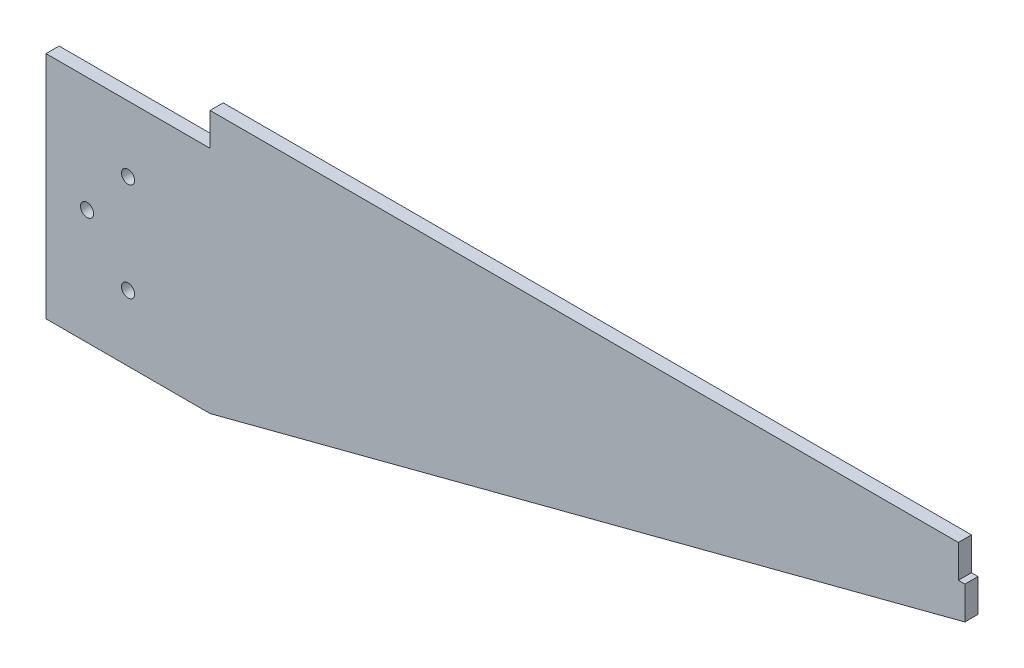
ISO-10303-21;
HEADER;
FILE_DESCRIPTION(('STEP AP214'),'2;1');
FILE_NAME('part.step','',(''),(''),'','','');
FILE_SCHEMA(('AUTOMOTIVE_DESIGN { 1 0 10303 214 1 1 1 1 }'));
ENDSEC;
DATA;
#1=APPLICATION_CONTEXT('core data for automotive mechanical design processes');
#2=APPLICATION_PROTOCOL_DEFINITION('international standard','automotive_design',2000,#1);
#3=PRODUCT_CONTEXT('',#1,'mechanical');
#4=PRODUCT('Part','Part','',(#3));
#5=PRODUCT_RELATED_PRODUCT_CATEGORY('part','',(#4));
#6=PRODUCT_DEFINITION_FORMATION('','',#4);
#7=PRODUCT_DEFINITION_CONTEXT('part definition',#1,'design');
#8=PRODUCT_DEFINITION('design','',#6,#7);
#9=PRODUCT_DEFINITION_SHAPE('','',#8);
#10=(LENGTH_UNIT() NAMED_UNIT(*) SI_UNIT(.MILLI.,.METRE.));
#11=(NAMED_UNIT(*) PLANE_ANGLE_UNIT() SI_UNIT($,.RADIAN.));
#12=(NAMED_UNIT(*) SI_UNIT($,.STERADIAN.) SOLID_ANGLE_UNIT());
#13=UNCERTAINTY_MEASURE_WITH_UNIT(LENGTH_MEASURE(1.E-05),#10,'distance_accuracy_value','');
#14=(GEOMETRIC_REPRESENTATION_CONTEXT(3) GLOBAL_UNCERTAINTY_ASSIGNED_CONTEXT((#13)) GLOBAL_UNIT_ASSIGNED_CONTEXT((#10,
#11,#12)) REPRESENTATION_CONTEXT('',''));
#15=CARTESIAN_POINT('',(0.,0.,0.));
#16=DIRECTION('',(0.,0.,1.));
#17=DIRECTION('',(1.,0.,0.));
#18=AXIS2_PLACEMENT_3D('',#15,#16,#17);
#19=CARTESIAN_POINT('',(130.000000000003,30.0929904361689,4.));
#20=DIRECTION('',(-7.7715611723666E-13,-1.,0.));
#21=DIRECTION('',(1.,-7.7715611723666E-13,0.));
#22=AXIS2_PLACEMENT_3D('',#19,#20,#21);
#23=PLANE('',#22);
#24=DIRECTION('',(-1.,7.7715611723666E-13,0.));
#25=VECTOR('',#24,1.);
#26=CARTESIAN_POINT('',(130.000000000003,30.0929904361689,0.));
#27=LINE('',#26,#25);
#28=CARTESIAN_POINT('',(130.000000000003,30.0929904361689,0.));
#29=VERTEX_POINT('',#28);
#30=CARTESIAN_POINT('',(128.,30.0929904361704,0.));
#31=VERTEX_POINT('',#30);
#32=EDGE_CURVE('E135',#29,#31,#27,.T.);
#33=ORIENTED_EDGE('',*,*,#32,.T.);
#34=DIRECTION('',(0.,0.,-1.));
#35=VECTOR('',#34,1.);
#36=CARTESIAN_POINT('',(128.,30.0929904361704,4.));
#37=LINE('',#36,#35);
#38=CARTESIAN_POINT('',(128.,30.0929904361704,4.));
#39=VERTEX_POINT('',#38);
#40=EDGE_CURVE('E11',#39,#31,#37,.T.);
#41=ORIENTED_EDGE('',*,*,#40,.F.);
#42=DIRECTION('',(-1.,7.7715611723666E-13,0.));
#43=VECTOR('',#42,1.);
#44=CARTESIAN_POINT('',(130.000000000003,30.0929904361689,4.));
#45=LINE('',#44,#43);
#46=CARTESIAN_POINT('',(130.000000000003,30.0929904361689,4.));
#47=VERTEX_POINT('',#46);
#48=EDGE_CURVE('E136',#47,#39,#45,.T.);
#49=ORIENTED_EDGE('',*,*,#48,.F.);
#50=DIRECTION('',(0.,0.,-1.));
#51=VECTOR('',#50,1.);
#52=CARTESIAN_POINT('',(130.000000000003,30.0929904361689,4.));
#53=LINE('',#52,#51);
#54=EDGE_CURVE('E152',#47,#29,#53,.T.);
#55=ORIENTED_EDGE('',*,*,#54,.T.);
#56=EDGE_LOOP('',(#33,#41,#49,#55));
#57=FACE_BOUND('',#56,.T.);
#58=ADVANCED_FACE('F36',(#57),#23,.F.);
#59=CARTESIAN_POINT('',(128.,30.0929904361704,4.));
#60=DIRECTION('',(-1.,0.,0.));
#61=DIRECTION('',(0.,0.,1.));
#62=AXIS2_PLACEMENT_3D('',#59,#60,#61);
#63=PLANE('',#62);
#64=DIRECTION('',(0.,1.,0.));
#65=VECTOR('',#64,1.);
#66=CARTESIAN_POINT('',(128.,30.0929904361704,0.));
#67=LINE('',#66,#65);
#68=CARTESIAN_POINT('',(128.,40.092990436171,0.));
#69=VERTEX_POINT('',#68);
#70=EDGE_CURVE('E155',#31,#69,#67,.T.);
#71=ORIENTED_EDGE('',*,*,#70,.T.);
#72=DIRECTION('',(0.,0.,-1.));
#73=VECTOR('',#72,1.);
#74=CARTESIAN_POINT('',(128.,40.092990436171,4.));
#75=LINE('',#74,#73);
#76=CARTESIAN_POINT('',(128.,40.092990436171,4.));
#77=VERTEX_POINT('',#76);
#78=EDGE_CURVE('E43',#77,#69,#75,.T.);
#79=ORIENTED_EDGE('',*,*,#78,.F.);
#80=DIRECTION('',(0.,1.,0.));
#81=VECTOR('',#80,1.);
#82=CARTESIAN_POINT('',(128.,30.0929904361704,4.));
#83=LINE('',#82,#81);
#84=EDGE_CURVE('E139',#39,#77,#83,.T.);
#85=ORIENTED_EDGE('',*,*,#84,.F.);
#86=ORIENTED_EDGE('',*,*,#40,.T.);
#87=EDGE_LOOP('',(#71,#79,#85,#86));
#88=FACE_BOUND('',#87,.T.);
#89=ADVANCED_FACE('F184',(#88),#63,.F.);
#90=CARTESIAN_POINT('',(128.,40.092990436171,4.));
#91=DIRECTION('',(0.,-1.,0.));
#92=DIRECTION('',(0.,0.,-1.));
#93=AXIS2_PLACEMENT_3D('',#90,#91,#92);
#94=PLANE('',#93);
#95=DIRECTION('',(-1.,0.,0.));
#96=VECTOR('',#95,1.);
#97=CARTESIAN_POINT('',(128.,40.092990436171,0.));
#98=LINE('',#97,#96);
#99=CARTESIAN_POINT('',(-99.9999999999943,40.092990436171,0.));
#100=VERTEX_POINT('',#99);
#101=EDGE_CURVE('E157',#69,#100,#98,.T.);
#102=ORIENTED_EDGE('',*,*,#101,.T.);
#103=DIRECTION('',(0.,0.,-1.));
#104=VECTOR('',#103,1.);
#105=CARTESIAN_POINT('',(-99.9999999999943,40.092990436171,4.));
#106=LINE('',#105,#104);
#107=CARTESIAN_POINT('',(-99.9999999999943,40.092990436171,4.));
#108=VERTEX_POINT('',#107);
#109=EDGE_CURVE('E172',#108,#100,#106,.T.);
#110=ORIENTED_EDGE('',*,*,#109,.F.);
#111=DIRECTION('',(-1.,0.,0.));
#112=VECTOR('',#111,1.);
#113=CARTESIAN_POINT('',(128.,40.092990436171,4.));
#114=LINE('',#113,#112);
#115=EDGE_CURVE('E142',#77,#108,#114,.T.);
#116=ORIENTED_EDGE('',*,*,#115,.F.);
#117=ORIENTED_EDGE('',*,*,#78,.T.);
#118=EDGE_LOOP('',(#102,#110,#116,#117));
#119=FACE_BOUND('',#118,.T.);
#120=ADVANCED_FACE('F178',(#119),#94,.F.);
#121=CARTESIAN_POINT('',(-99.9999999999943,40.092990436171,4.));
#122=DIRECTION('',(1.,0.,0.));
#123=DIRECTION('',(0.,0.,-1.));
#124=AXIS2_PLACEMENT_3D('',#121,#122,#123);
#125=PLANE('',#124);
#126=DIRECTION('',(0.,-1.,0.));
#127=VECTOR('',#126,1.);
#128=CARTESIAN_POINT('',(-99.9999999999943,40.092990436171,0.));
#129=LINE('',#128,#127);
#130=CARTESIAN_POINT('',(-99.9999999999943,30.0929904361709,0.));
#131=VERTEX_POINT('',#130);
#132=EDGE_CURVE('E55',#100,#131,#129,.T.);
#133=ORIENTED_EDGE('',*,*,#132,.T.);
#134=DIRECTION('',(0.,0.,1.));
#135=VECTOR('',#134,1.);
#136=CARTESIAN_POINT('',(-99.9999999999943,30.0929904361709,-86.0232526704847));
#137=LINE('',#136,#135);
#138=CARTESIAN_POINT('',(-99.9999999999943,30.0929904361709,4.));
#139=VERTEX_POINT('',#138);
#140=EDGE_CURVE('E50',#131,#139,#137,.T.);
#141=ORIENTED_EDGE('',*,*,#140,.T.);
#142=DIRECTION('',(0.,-1.,0.));
#143=VECTOR('',#142,1.);
#144=CARTESIAN_POINT('',(-99.9999999999943,40.092990436171,4.));
#145=LINE('',#144,#143);
#146=EDGE_CURVE('E144',#108,#139,#145,.T.);
#147=ORIENTED_EDGE('',*,*,#146,.F.);
#148=ORIENTED_EDGE('',*,*,#109,.T.);
#149=EDGE_LOOP('',(#133,#141,#147,#148));
#150=FACE_BOUND('',#149,.T.);
#151=ADVANCED_FACE('F249',(#150),#125,.F.);
#152=CARTESIAN_POINT('',(-130.000000000003,-39.907009563829,4.));
#153=DIRECTION('',(0.,1.,0.));
#154=DIRECTION('',(0.,0.,1.));
#155=AXIS2_PLACEMENT_3D('',#152,#153,#154);
#156=PLANE('',#155);
#157=DIRECTION('',(1.,0.,0.));
#158=VECTOR('',#157,1.);
#159=CARTESIAN_POINT('',(-130.000000000003,-39.907009563829,0.));
#160=LINE('',#159,#158);
#161=CARTESIAN_POINT('',(-149.999999999961,-39.9070095639004,0.));
#162=VERTEX_POINT('',#161);
#163=CARTESIAN_POINT('',(-100.000000000001,-39.907009563829,0.));
#164=VERTEX_POINT('',#163);
#165=EDGE_CURVE('E112',#162,#164,#160,.T.);
#166=ORIENTED_EDGE('',*,*,#165,.T.);
#167=DIRECTION('',(0.,0.,-1.));
#168=VECTOR('',#167,1.);
#169=CARTESIAN_POINT('',(-100.000000000001,-39.907009563829,4.));
#170=LINE('',#169,#168);
#171=CARTESIAN_POINT('',(-100.000000000001,-39.907009563829,4.));
#172=VERTEX_POINT('',#171);
#173=EDGE_CURVE('E169',#172,#164,#170,.T.);
#174=ORIENTED_EDGE('',*,*,#173,.F.);
#175=DIRECTION('',(1.,0.,0.));
#176=VECTOR('',#175,1.);
#177=CARTESIAN_POINT('',(-130.000000000003,-39.907009563829,4.));
#178=LINE('',#177,#176);
#179=CARTESIAN_POINT('',(-149.999999999961,-39.9070095639004,4.));
#180=VERTEX_POINT('',#179);
#181=EDGE_CURVE('E146',#180,#172,#178,.T.);
#182=ORIENTED_EDGE('',*,*,#181,.F.);
#183=DIRECTION('',(0.,0.,1.));
#184=VECTOR('',#183,1.);
#185=CARTESIAN_POINT('',(-149.999999999961,-39.9070095639004,-86.0232526704847));
#186=LINE('',#185,#184);
#187=EDGE_CURVE('E116',#162,#180,#186,.T.);
#188=ORIENTED_EDGE('',*,*,#187,.F.);
#189=EDGE_LOOP('',(#166,#174,#182,#188));
#190=FACE_BOUND('',#189,.T.);
#191=ADVANCED_FACE('F197',(#190),#156,.F.);
#192=CARTESIAN_POINT('',(-100.000000000001,-39.907009563829,4.));
#193=DIRECTION('',(-0.252421897146999,0.967617272396845,0.));
#194=DIRECTION('',(-0.967617272396845,-0.252421897146999,0.));
#195=AXIS2_PLACEMENT_3D('',#192,#193,#194);
#196=PLANE('',#195);
#197=DIRECTION('',(0.967617272396845,0.252421897146999,0.));
#198=VECTOR('',#197,1.);
#199=CARTESIAN_POINT('',(-100.000000000001,-39.907009563829,0.));
#200=LINE('',#199,#198);
#201=CARTESIAN_POINT('',(130.000000000003,20.0929904361711,0.));
#202=VERTEX_POINT('',#201);
#203=EDGE_CURVE('E161',#164,#202,#200,.T.);
#204=ORIENTED_EDGE('',*,*,#203,.T.);
#205=DIRECTION('',(0.,0.,-1.));
#206=VECTOR('',#205,1.);
#207=CARTESIAN_POINT('',(130.000000000003,20.0929904361711,4.));
#208=LINE('',#207,#206);
#209=CARTESIAN_POINT('',(130.000000000003,20.0929904361711,4.));
#210=VERTEX_POINT('',#209);
#211=EDGE_CURVE('E166',#210,#202,#208,.T.);
#212=ORIENTED_EDGE('',*,*,#211,.F.);
#213=DIRECTION('',(0.967617272396845,0.252421897146999,0.));
#214=VECTOR('',#213,1.);
#215=CARTESIAN_POINT('',(-100.000000000001,-39.907009563829,4.));
#216=LINE('',#215,#214);
#217=EDGE_CURVE('E148',#172,#210,#216,.T.);
#218=ORIENTED_EDGE('',*,*,#217,.F.);
#219=ORIENTED_EDGE('',*,*,#173,.T.);
#220=EDGE_LOOP('',(#204,#212,#218,#219));
#221=FACE_BOUND('',#220,.T.);
#222=ADVANCED_FACE('F193',(#221),#196,.F.);
#223=CARTESIAN_POINT('',(130.000000000003,20.0929904361711,4.));
#224=DIRECTION('',(-1.,0.,0.));
#225=DIRECTION('',(0.,0.,1.));
#226=AXIS2_PLACEMENT_3D('',#223,#224,#225);
#227=PLANE('',#226);
#228=DIRECTION('',(0.,1.,0.));
#229=VECTOR('',#228,1.);
#230=CARTESIAN_POINT('',(130.000000000003,20.0929904361711,0.));
#231=LINE('',#230,#229);
#232=EDGE_CURVE('E140',#202,#29,#231,.T.);
#233=ORIENTED_EDGE('',*,*,#232,.T.);
#234=ORIENTED_EDGE('',*,*,#54,.F.);
#235=DIRECTION('',(0.,1.,0.));
#236=VECTOR('',#235,1.);
#237=CARTESIAN_POINT('',(130.000000000003,20.0929904361711,4.));
#238=LINE('',#237,#236);
#239=EDGE_CURVE('E150',#210,#47,#238,.T.);
#240=ORIENTED_EDGE('',*,*,#239,.F.);
#241=ORIENTED_EDGE('',*,*,#211,.T.);
#242=EDGE_LOOP('',(#233,#234,#240,#241));
#243=FACE_BOUND('',#242,.T.);
#244=ADVANCED_FACE('F190',(#243),#227,.F.);
#245=CARTESIAN_POINT('',(0.,0.,4.));
#246=DIRECTION('',(0.,0.,-1.));
#247=DIRECTION('',(-1.,0.,0.));
#248=AXIS2_PLACEMENT_3D('',#245,#246,#247);
#249=PLANE('',#248);
#250=CARTESIAN_POINT('',(-124.999999999981,10.0929904361709,4.));
#251=DIRECTION('',(0.,0.,1.));
#252=DIRECTION('',(1.,0.,0.));
#253=AXIS2_PLACEMENT_3D('',#250,#251,#252);
#254=CIRCLE('',#253,1.9999999999837);
#255=CARTESIAN_POINT('',(-122.999999999997,10.0929904361709,4.));
#256=VERTEX_POINT('',#255);
#257=EDGE_CURVE('E200',#256,#256,#254,.T.);
#258=ORIENTED_EDGE('',*,*,#257,.F.);
#259=EDGE_LOOP('',(#258));
#260=FACE_BOUND('',#259,.T.);
#261=CARTESIAN_POINT('',(-124.999999999981,-19.9070095639004,4.));
#262=DIRECTION('',(0.,0.,1.));
#263=DIRECTION('',(1.,0.,0.));
#264=AXIS2_PLACEMENT_3D('',#261,#262,#263);
#265=CIRCLE('',#264,2.0000000000046);
#266=CARTESIAN_POINT('',(-122.999999999976,-19.9070095639004,4.));
#267=VERTEX_POINT('',#266);
#268=EDGE_CURVE('E207',#267,#267,#265,.T.);
#269=ORIENTED_EDGE('',*,*,#268,.F.);
#270=EDGE_LOOP('',(#269));
#271=FACE_BOUND('',#270,.T.);
#272=CARTESIAN_POINT('',(-137.499999999971,-4.90700956386478,4.));
#273=DIRECTION('',(0.,0.,1.));
#274=DIRECTION('',(1.,0.,0.));
#275=AXIS2_PLACEMENT_3D('',#272,#273,#274);
#276=CIRCLE('',#275,1.99999999998595);
#277=CARTESIAN_POINT('',(-135.499999999985,-4.90700956386478,4.));
#278=VERTEX_POINT('',#277);
#279=EDGE_CURVE('E215',#278,#278,#276,.T.);
#280=ORIENTED_EDGE('',*,*,#279,.F.);
#281=EDGE_LOOP('',(#280));
#282=FACE_BOUND('',#281,.T.);
#283=DIRECTION('',(4.90877180173051E-13,-1.,0.));
#284=VECTOR('',#283,1.);
#285=CARTESIAN_POINT('',(-149.99999999998,-7.3631577025948E-11,4.));
#286=LINE('',#285,#284);
#287=CARTESIAN_POINT('',(-149.999999999995,30.0929904361709,4.));
#288=VERTEX_POINT('',#287);
#289=EDGE_CURVE('E122',#288,#180,#286,.T.);
#290=ORIENTED_EDGE('',*,*,#289,.T.);
#291=ORIENTED_EDGE('',*,*,#181,.T.);
#292=ORIENTED_EDGE('',*,*,#217,.T.);
#293=ORIENTED_EDGE('',*,*,#239,.T.);
#294=ORIENTED_EDGE('',*,*,#48,.T.);
#295=ORIENTED_EDGE('',*,*,#84,.T.);
#296=ORIENTED_EDGE('',*,*,#115,.T.);
#297=ORIENTED_EDGE('',*,*,#146,.T.);
#298=DIRECTION('',(-1.,0.,0.));
#299=VECTOR('',#298,1.);
#300=CARTESIAN_POINT('',(0.,30.0929904361709,4.));
#301=LINE('',#300,#299);
#302=EDGE_CURVE('E129',#139,#288,#301,.T.);
#303=ORIENTED_EDGE('',*,*,#302,.T.);
#304=EDGE_LOOP('',(#290,#291,#292,#293,#294,#295,#296,#297,#303));
#305=FACE_BOUND('',#304,.T.);
#306=ADVANCED_FACE('F199',(#260,#271,#282,#305),#249,.F.);
#307=CARTESIAN_POINT('',(0.,0.,0.));
#308=DIRECTION('',(0.,0.,-1.));
#309=DIRECTION('',(-1.,0.,0.));
#310=AXIS2_PLACEMENT_3D('',#307,#308,#309);
#311=PLANE('',#310);
#312=CARTESIAN_POINT('',(-124.999999999981,10.0929904361709,0.));
#313=DIRECTION('',(0.,0.,-1.));
#314=DIRECTION('',(-1.,0.,0.));
#315=AXIS2_PLACEMENT_3D('',#312,#313,#314);
#316=CIRCLE('',#315,1.9999999999837);
#317=CARTESIAN_POINT('',(-126.999999999965,10.0929904361709,0.));
#318=VERTEX_POINT('',#317);
#319=EDGE_CURVE('E202',#318,#318,#316,.F.);
#320=ORIENTED_EDGE('',*,*,#319,.T.);
#321=EDGE_LOOP('',(#320));
#322=FACE_BOUND('',#321,.T.);
#323=CARTESIAN_POINT('',(-124.999999999981,-19.9070095639004,0.));
#324=DIRECTION('',(0.,0.,-1.));
#325=DIRECTION('',(-1.,0.,0.));
#326=AXIS2_PLACEMENT_3D('',#323,#324,#325);
#327=CIRCLE('',#326,2.0000000000046);
#328=CARTESIAN_POINT('',(-126.999999999986,-19.9070095639004,0.));
#329=VERTEX_POINT('',#328);
#330=EDGE_CURVE('E212',#329,#329,#327,.F.);
#331=ORIENTED_EDGE('',*,*,#330,.T.);
#332=EDGE_LOOP('',(#331));
#333=FACE_BOUND('',#332,.T.);
#334=CARTESIAN_POINT('',(-137.499999999971,-4.90700956386478,0.));
#335=DIRECTION('',(0.,0.,-1.));
#336=DIRECTION('',(-1.,0.,0.));
#337=AXIS2_PLACEMENT_3D('',#334,#335,#336);
#338=CIRCLE('',#337,1.99999999998595);
#339=CARTESIAN_POINT('',(-139.499999999957,-4.90700956386478,0.));
#340=VERTEX_POINT('',#339);
#341=EDGE_CURVE('E218',#340,#340,#338,.F.);
#342=ORIENTED_EDGE('',*,*,#341,.T.);
#343=EDGE_LOOP('',(#342));
#344=FACE_BOUND('',#343,.T.);
#345=ORIENTED_EDGE('',*,*,#165,.F.);
#346=DIRECTION('',(4.90877180173051E-13,-1.,0.));
#347=VECTOR('',#346,1.);
#348=CARTESIAN_POINT('',(-149.99999999998,-7.3631577025948E-11,0.));
#349=LINE('',#348,#347);
#350=CARTESIAN_POINT('',(-149.999999999995,30.0929904361709,0.));
#351=VERTEX_POINT('',#350);
#352=EDGE_CURVE('E106',#351,#162,#349,.T.);
#353=ORIENTED_EDGE('',*,*,#352,.F.);
#354=DIRECTION('',(-1.,0.,0.));
#355=VECTOR('',#354,1.);
#356=CARTESIAN_POINT('',(0.,30.0929904361709,0.));
#357=LINE('',#356,#355);
#358=EDGE_CURVE('E110',#131,#351,#357,.T.);
#359=ORIENTED_EDGE('',*,*,#358,.F.);
#360=ORIENTED_EDGE('',*,*,#132,.F.);
#361=ORIENTED_EDGE('',*,*,#101,.F.);
#362=ORIENTED_EDGE('',*,*,#70,.F.);
#363=ORIENTED_EDGE('',*,*,#32,.F.);
#364=ORIENTED_EDGE('',*,*,#232,.F.);
#365=ORIENTED_EDGE('',*,*,#203,.F.);
#366=EDGE_LOOP('',(#345,#353,#359,#360,#361,#362,#363,#364,#365));
#367=FACE_BOUND('',#366,.T.);
#368=ADVANCED_FACE('F108',(#322,#333,#344,#367),#311,.T.);
#369=CARTESIAN_POINT('',(0.,30.0929904361709,-86.0232526704847));
#370=DIRECTION('',(0.,1.,0.));
#371=DIRECTION('',(0.,0.,1.));
#372=AXIS2_PLACEMENT_3D('',#369,#370,#371);
#373=PLANE('',#372);
#374=ORIENTED_EDGE('',*,*,#140,.F.);
#375=ORIENTED_EDGE('',*,*,#358,.T.);
#376=DIRECTION('',(0.,0.,1.));
#377=VECTOR('',#376,1.);
#378=CARTESIAN_POINT('',(-149.999999999995,30.0929904361709,-86.0232526704847));
#379=LINE('',#378,#377);
#380=EDGE_CURVE('E117',#351,#288,#379,.T.);
#381=ORIENTED_EDGE('',*,*,#380,.T.);
#382=ORIENTED_EDGE('',*,*,#302,.F.);
#383=EDGE_LOOP('',(#374,#375,#381,#382));
#384=FACE_BOUND('',#383,.T.);
#385=ADVANCED_FACE('F127',(#384),#373,.T.);
#386=CARTESIAN_POINT('',(-149.99999999998,-7.3631577025948E-11,-86.0232526704847));
#387=DIRECTION('',(-1.,-4.90877180173051E-13,0.));
#388=DIRECTION('',(4.90877180173051E-13,-1.,0.));
#389=AXIS2_PLACEMENT_3D('',#386,#387,#388);
#390=PLANE('',#389);
#391=ORIENTED_EDGE('',*,*,#380,.F.);
#392=ORIENTED_EDGE('',*,*,#352,.T.);
#393=ORIENTED_EDGE('',*,*,#187,.T.);
#394=ORIENTED_EDGE('',*,*,#289,.F.);
#395=EDGE_LOOP('',(#391,#392,#393,#394));
#396=FACE_BOUND('',#395,.T.);
#397=ADVANCED_FACE('F120',(#396),#390,.T.);
#398=CARTESIAN_POINT('',(-137.499999999971,-4.90700956386478,-0.00100000000000013));
#399=DIRECTION('',(0.,0.,1.));
#400=DIRECTION('',(1.,0.,0.));
#401=AXIS2_PLACEMENT_3D('',#398,#399,#400);
#402=CYLINDRICAL_SURFACE('',#401,1.99999999998595);
#403=ORIENTED_EDGE('',*,*,#341,.F.);
#404=EDGE_LOOP('',(#403));
#405=FACE_BOUND('',#404,.T.);
#406=ORIENTED_EDGE('',*,*,#279,.T.);
#407=EDGE_LOOP('',(#406));
#408=FACE_BOUND('',#407,.T.);
#409=ADVANCED_FACE('F223',(#405,#408),#402,.F.);
#410=CARTESIAN_POINT('',(-124.999999999981,-19.9070095639004,-0.00100000000000013));
#411=DIRECTION('',(0.,0.,1.));
#412=DIRECTION('',(1.,0.,0.));
#413=AXIS2_PLACEMENT_3D('',#410,#411,#412);
#414=CYLINDRICAL_SURFACE('',#413,2.0000000000046);
#415=ORIENTED_EDGE('',*,*,#330,.F.);
#416=EDGE_LOOP('',(#415));
#417=FACE_BOUND('',#416,.T.);
#418=ORIENTED_EDGE('',*,*,#268,.T.);
#419=EDGE_LOOP('',(#418));
#420=FACE_BOUND('',#419,.T.);
#421=ADVANCED_FACE('F226',(#417,#420),#414,.F.);
#422=CARTESIAN_POINT('',(-124.999999999981,10.0929904361709,-0.00100000000000013));
#423=DIRECTION('',(0.,0.,1.));
#424=DIRECTION('',(1.,0.,0.));
#425=AXIS2_PLACEMENT_3D('',#422,#423,#424);
#426=CYLINDRICAL_SURFACE('',#425,1.9999999999837);
#427=ORIENTED_EDGE('',*,*,#319,.F.);
#428=EDGE_LOOP('',(#427));
#429=FACE_BOUND('',#428,.T.);
#430=ORIENTED_EDGE('',*,*,#257,.T.);
#431=EDGE_LOOP('',(#430));
#432=FACE_BOUND('',#431,.T.);
#433=ADVANCED_FACE('F320',(#429,#432),#426,.F.);
#434=CLOSED_SHELL('',(#58,#89,#120,#151,#191,#222,#244,#306,#368,#385,#397,#409,#421,#433));
#435=MANIFOLD_SOLID_BREP('B2',#434);
#436=ADVANCED_BREP_SHAPE_REPRESENTATION('',(#18,#435),#14);
#437=SHAPE_DEFINITION_REPRESENTATION(#9,#436);
ENDSEC;
END-ISO-10303-21;
